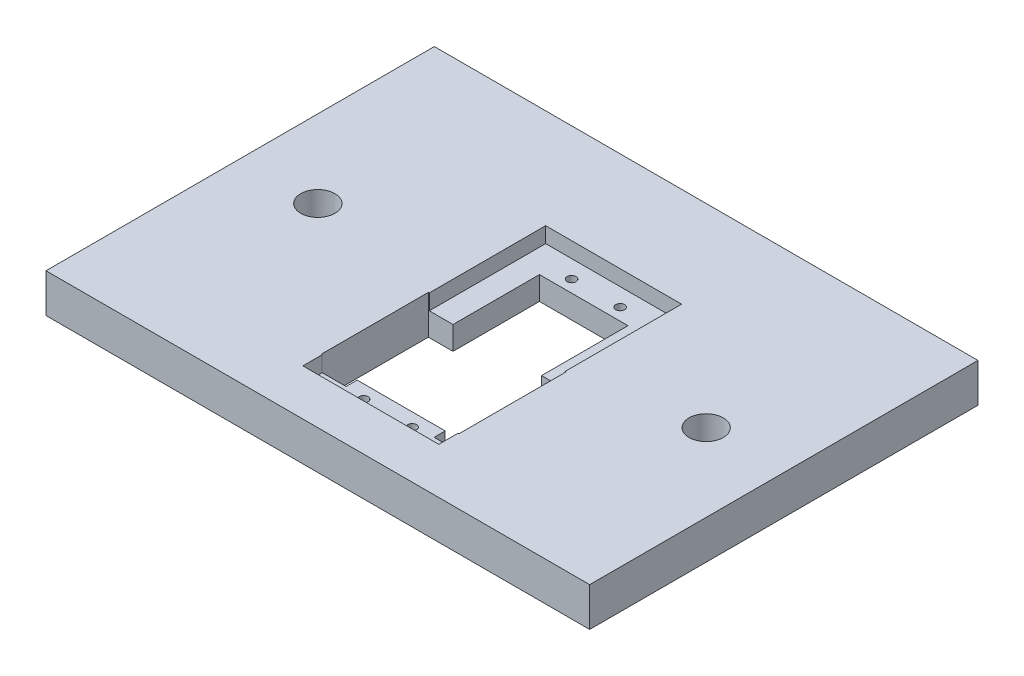
ISO-10303-21;
HEADER;
FILE_DESCRIPTION(('STEP AP214'),'2;1');
FILE_NAME('part.step','',(''),(''),'','','');
FILE_SCHEMA(('AUTOMOTIVE_DESIGN { 1 0 10303 214 1 1 1 1 }'));
ENDSEC;
DATA;
#1=APPLICATION_CONTEXT('core data for automotive mechanical design processes');
#2=APPLICATION_PROTOCOL_DEFINITION('international standard','automotive_design',2000,#1);
#3=PRODUCT_CONTEXT('',#1,'mechanical');
#4=PRODUCT('Part','Part','',(#3));
#5=PRODUCT_RELATED_PRODUCT_CATEGORY('part','',(#4));
#6=PRODUCT_DEFINITION_FORMATION('','',#4);
#7=PRODUCT_DEFINITION_CONTEXT('part definition',#1,'design');
#8=PRODUCT_DEFINITION('design','',#6,#7);
#9=PRODUCT_DEFINITION_SHAPE('','',#8);
#10=(LENGTH_UNIT() NAMED_UNIT(*) SI_UNIT(.MILLI.,.METRE.));
#11=(NAMED_UNIT(*) PLANE_ANGLE_UNIT() SI_UNIT($,.RADIAN.));
#12=(NAMED_UNIT(*) SI_UNIT($,.STERADIAN.) SOLID_ANGLE_UNIT());
#13=UNCERTAINTY_MEASURE_WITH_UNIT(LENGTH_MEASURE(1.E-05),#10,'distance_accuracy_value','');
#14=(GEOMETRIC_REPRESENTATION_CONTEXT(3) GLOBAL_UNCERTAINTY_ASSIGNED_CONTEXT((#13)) GLOBAL_UNIT_ASSIGNED_CONTEXT((#10,
#11,#12)) REPRESENTATION_CONTEXT('',''));
#15=CARTESIAN_POINT('',(0.,0.,0.));
#16=DIRECTION('',(0.,0.,1.));
#17=DIRECTION('',(1.,0.,0.));
#18=AXIS2_PLACEMENT_3D('',#15,#16,#17);
#19=CARTESIAN_POINT('',(-12.2080655373622,12.7,38.5061507826569));
#20=DIRECTION('',(0.,0.,-1.));
#21=DIRECTION('',(-1.,0.,0.));
#22=AXIS2_PLACEMENT_3D('',#19,#20,#21);
#23=PLANE('',#22);
#24=DIRECTION('',(0.,1.,0.));
#25=VECTOR('',#24,1.);
#26=CARTESIAN_POINT('',(-12.1271424501678,12.7,38.5061507826569));
#27=LINE('',#26,#25);
#28=CARTESIAN_POINT('',(-12.1271424501678,0.,38.5061507826569));
#29=VERTEX_POINT('',#28);
#30=CARTESIAN_POINT('',(-12.1271424501678,7.62,38.5061507826569));
#31=VERTEX_POINT('',#30);
#32=EDGE_CURVE('E406',#29,#31,#27,.T.);
#33=ORIENTED_EDGE('',*,*,#32,.T.);
#34=DIRECTION('',(1.,0.,0.));
#35=VECTOR('',#34,1.);
#36=CARTESIAN_POINT('',(-12.2080655373622,7.62,38.5061507826569));
#37=LINE('',#36,#35);
#38=CARTESIAN_POINT('',(16.6670113754435,7.62,38.5061507826569));
#39=VERTEX_POINT('',#38);
#40=EDGE_CURVE('E240',#31,#39,#37,.T.);
#41=ORIENTED_EDGE('',*,*,#40,.T.);
#42=DIRECTION('',(0.,-1.,0.));
#43=VECTOR('',#42,1.);
#44=CARTESIAN_POINT('',(16.6670113754435,12.7,38.5061507826569));
#45=LINE('',#44,#43);
#46=CARTESIAN_POINT('',(16.6670113754435,0.,38.5061507826569));
#47=VERTEX_POINT('',#46);
#48=EDGE_CURVE('E402',#39,#47,#45,.T.);
#49=ORIENTED_EDGE('',*,*,#48,.T.);
#50=DIRECTION('',(1.,0.,0.));
#51=VECTOR('',#50,1.);
#52=CARTESIAN_POINT('',(-12.2080655373622,0.,38.5061507826569));
#53=LINE('',#52,#51);
#54=EDGE_CURVE('E344',#29,#47,#53,.T.);
#55=ORIENTED_EDGE('',*,*,#54,.F.);
#56=EDGE_LOOP('',(#33,#41,#49,#55));
#57=FACE_BOUND('',#56,.T.);
#58=ADVANCED_FACE('F34',(#57),#23,.T.);
#59=CARTESIAN_POINT('',(-12.2080655373622,12.7,38.5061507826569));
#60=DIRECTION('',(1.,0.,0.));
#61=DIRECTION('',(0.,0.,-1.));
#62=AXIS2_PLACEMENT_3D('',#59,#60,#61);
#63=PLANE('',#62);
#64=DIRECTION('',(0.,-1.,0.));
#65=VECTOR('',#64,1.);
#66=CARTESIAN_POINT('',(-12.2080655373622,12.7,-21.1838492173431));
#67=LINE('',#66,#65);
#68=CARTESIAN_POINT('',(-12.2080655373622,7.62,-21.1838492173431));
#69=VERTEX_POINT('',#68);
#70=CARTESIAN_POINT('',(-12.2080655373622,0.,-21.1838492173431));
#71=VERTEX_POINT('',#70);
#72=EDGE_CURVE('E353',#69,#71,#67,.T.);
#73=ORIENTED_EDGE('',*,*,#72,.F.);
#74=DIRECTION('',(0.,0.,1.));
#75=VECTOR('',#74,1.);
#76=CARTESIAN_POINT('',(-12.2080655373622,7.62,38.5061507826569));
#77=LINE('',#76,#75);
#78=CARTESIAN_POINT('',(-12.2080655373622,7.62,7.08952578265694));
#79=VERTEX_POINT('',#78);
#80=EDGE_CURVE('E252',#69,#79,#77,.T.);
#81=ORIENTED_EDGE('',*,*,#80,.T.);
#82=DIRECTION('',(0.,-1.,0.));
#83=VECTOR('',#82,1.);
#84=CARTESIAN_POINT('',(-12.2080655373622,12.7,7.08952578265694));
#85=LINE('',#84,#83);
#86=CARTESIAN_POINT('',(-12.2080655373622,0.,7.08952578265694));
#87=VERTEX_POINT('',#86);
#88=EDGE_CURVE('E404',#79,#87,#85,.T.);
#89=ORIENTED_EDGE('',*,*,#88,.T.);
#90=DIRECTION('',(0.,0.,1.));
#91=VECTOR('',#90,1.);
#92=CARTESIAN_POINT('',(-12.2080655373622,0.,38.5061507826569));
#93=LINE('',#92,#91);
#94=EDGE_CURVE('E341',#71,#87,#93,.T.);
#95=ORIENTED_EDGE('',*,*,#94,.F.);
#96=EDGE_LOOP('',(#73,#81,#89,#95));
#97=FACE_BOUND('',#96,.T.);
#98=ADVANCED_FACE('F485',(#97),#63,.T.);
#99=CARTESIAN_POINT('',(16.7479344626378,12.7,38.5061507826569));
#100=DIRECTION('',(-1.,0.,0.));
#101=DIRECTION('',(0.,0.,1.));
#102=AXIS2_PLACEMENT_3D('',#99,#100,#101);
#103=PLANE('',#102);
#104=DIRECTION('',(0.,1.,0.));
#105=VECTOR('',#104,1.);
#106=CARTESIAN_POINT('',(16.7479344626378,12.7,7.08952578265694));
#107=LINE('',#106,#105);
#108=CARTESIAN_POINT('',(16.7479344626378,0.,7.08952578265694));
#109=VERTEX_POINT('',#108);
#110=CARTESIAN_POINT('',(16.7479344626378,7.62,7.08952578265694));
#111=VERTEX_POINT('',#110);
#112=EDGE_CURVE('E399',#109,#111,#107,.T.);
#113=ORIENTED_EDGE('',*,*,#112,.T.);
#114=DIRECTION('',(0.,0.,-1.));
#115=VECTOR('',#114,1.);
#116=CARTESIAN_POINT('',(16.7479344626378,7.62,38.5061507826569));
#117=LINE('',#116,#115);
#118=CARTESIAN_POINT('',(16.7479344626378,7.62,-21.1838492173431));
#119=VERTEX_POINT('',#118);
#120=EDGE_CURVE('E258',#111,#119,#117,.T.);
#121=ORIENTED_EDGE('',*,*,#120,.T.);
#122=DIRECTION('',(0.,-1.,0.));
#123=VECTOR('',#122,1.);
#124=CARTESIAN_POINT('',(16.7479344626378,12.7,-21.1838492173431));
#125=LINE('',#124,#123);
#126=CARTESIAN_POINT('',(16.7479344626378,0.,-21.1838492173431));
#127=VERTEX_POINT('',#126);
#128=EDGE_CURVE('E355',#119,#127,#125,.T.);
#129=ORIENTED_EDGE('',*,*,#128,.T.);
#130=DIRECTION('',(0.,0.,-1.));
#131=VECTOR('',#130,1.);
#132=CARTESIAN_POINT('',(16.7479344626378,0.,38.5061507826569));
#133=LINE('',#132,#131);
#134=EDGE_CURVE('E347',#109,#127,#133,.T.);
#135=ORIENTED_EDGE('',*,*,#134,.F.);
#136=EDGE_LOOP('',(#113,#121,#129,#135));
#137=FACE_BOUND('',#136,.T.);
#138=ADVANCED_FACE('F490',(#137),#103,.T.);
#139=CARTESIAN_POINT('',(-12.2080655373622,12.7,-21.1838492173431));
#140=DIRECTION('',(0.,0.,1.));
#141=DIRECTION('',(1.,0.,0.));
#142=AXIS2_PLACEMENT_3D('',#139,#140,#141);
#143=PLANE('',#142);
#144=ORIENTED_EDGE('',*,*,#128,.F.);
#145=DIRECTION('',(-1.,0.,0.));
#146=VECTOR('',#145,1.);
#147=CARTESIAN_POINT('',(-12.2080655373622,7.62,-21.1838492173431));
#148=LINE('',#147,#146);
#149=EDGE_CURVE('E255',#119,#69,#148,.T.);
#150=ORIENTED_EDGE('',*,*,#149,.T.);
#151=ORIENTED_EDGE('',*,*,#72,.T.);
#152=DIRECTION('',(-1.,0.,0.));
#153=VECTOR('',#152,1.);
#154=CARTESIAN_POINT('',(-12.2080655373622,0.,-21.1838492173431));
#155=LINE('',#154,#153);
#156=EDGE_CURVE('E350',#127,#71,#155,.T.);
#157=ORIENTED_EDGE('',*,*,#156,.F.);
#158=EDGE_LOOP('',(#144,#150,#151,#157));
#159=FACE_BOUND('',#158,.T.);
#160=ADVANCED_FACE('F588',(#159),#143,.T.);
#161=CARTESIAN_POINT('',(-5.66756553736215,12.7,42.8717757826569));
#162=DIRECTION('',(0.,-1.,0.));
#163=DIRECTION('',(0.,0.,-1.));
#164=AXIS2_PLACEMENT_3D('',#161,#162,#163);
#165=CYLINDRICAL_SURFACE('',#164,1.4605);
#166=CARTESIAN_POINT('',(-5.66756553736215,0.,42.8717757826569));
#167=DIRECTION('',(0.,1.,0.));
#168=DIRECTION('',(0.,0.,1.));
#169=AXIS2_PLACEMENT_3D('',#166,#167,#168);
#170=CIRCLE('',#169,1.4605);
#171=CARTESIAN_POINT('',(-5.66756553736215,0.,44.3322757826569));
#172=VERTEX_POINT('',#171);
#173=EDGE_CURVE('E338',#172,#172,#170,.T.);
#174=ORIENTED_EDGE('',*,*,#173,.F.);
#175=EDGE_LOOP('',(#174));
#176=FACE_BOUND('',#175,.T.);
#177=CARTESIAN_POINT('',(-5.66756553736215,7.62,42.8717757826569));
#178=DIRECTION('',(0.,1.,0.));
#179=DIRECTION('',(0.,0.,1.));
#180=AXIS2_PLACEMENT_3D('',#177,#178,#179);
#181=CIRCLE('',#180,1.4605);
#182=CARTESIAN_POINT('',(-5.66756553736215,7.62,44.3322757826569));
#183=VERTEX_POINT('',#182);
#184=EDGE_CURVE('E271',#183,#183,#181,.T.);
#185=ORIENTED_EDGE('',*,*,#184,.T.);
#186=EDGE_LOOP('',(#185));
#187=FACE_BOUND('',#186,.T.);
#188=ADVANCED_FACE('F579',(#176,#187),#165,.F.);
#189=CARTESIAN_POINT('',(10.2074344626382,12.7,42.8717757826569));
#190=DIRECTION('',(0.,-1.,0.));
#191=DIRECTION('',(0.,0.,-1.));
#192=AXIS2_PLACEMENT_3D('',#189,#190,#191);
#193=CYLINDRICAL_SURFACE('',#192,1.46049999999967);
#194=CARTESIAN_POINT('',(10.2074344626382,0.,42.8717757826569));
#195=DIRECTION('',(0.,1.,0.));
#196=DIRECTION('',(0.,0.,1.));
#197=AXIS2_PLACEMENT_3D('',#194,#195,#196);
#198=CIRCLE('',#197,1.46049999999967);
#199=CARTESIAN_POINT('',(10.2074344626382,0.,44.3322757826566));
#200=VERTEX_POINT('',#199);
#201=EDGE_CURVE('E335',#200,#200,#198,.T.);
#202=ORIENTED_EDGE('',*,*,#201,.F.);
#203=EDGE_LOOP('',(#202));
#204=FACE_BOUND('',#203,.T.);
#205=CARTESIAN_POINT('',(10.2074344626382,7.62,42.8717757826569));
#206=DIRECTION('',(0.,1.,0.));
#207=DIRECTION('',(0.,0.,1.));
#208=AXIS2_PLACEMENT_3D('',#205,#206,#207);
#209=CIRCLE('',#208,1.46049999999967);
#210=CARTESIAN_POINT('',(10.2074344626382,7.62,44.3322757826566));
#211=VERTEX_POINT('',#210);
#212=EDGE_CURVE('E268',#211,#211,#209,.T.);
#213=ORIENTED_EDGE('',*,*,#212,.T.);
#214=EDGE_LOOP('',(#213));
#215=FACE_BOUND('',#214,.T.);
#216=ADVANCED_FACE('F577',(#204,#215),#193,.F.);
#217=CARTESIAN_POINT('',(-5.66756553736239,12.7,-25.1494242173431));
#218=DIRECTION('',(0.,-1.,0.));
#219=DIRECTION('',(0.,0.,-1.));
#220=AXIS2_PLACEMENT_3D('',#217,#218,#219);
#221=CYLINDRICAL_SURFACE('',#220,1.4605);
#222=CARTESIAN_POINT('',(-5.66756553736239,0.,-25.1494242173431));
#223=DIRECTION('',(0.,1.,0.));
#224=DIRECTION('',(0.,0.,1.));
#225=AXIS2_PLACEMENT_3D('',#222,#223,#224);
#226=CIRCLE('',#225,1.4605);
#227=CARTESIAN_POINT('',(-5.66756553736239,0.,-23.6889242173431));
#228=VERTEX_POINT('',#227);
#229=EDGE_CURVE('E332',#228,#228,#226,.T.);
#230=ORIENTED_EDGE('',*,*,#229,.F.);
#231=EDGE_LOOP('',(#230));
#232=FACE_BOUND('',#231,.T.);
#233=CARTESIAN_POINT('',(-5.66756553736239,7.62,-25.1494242173431));
#234=DIRECTION('',(0.,1.,0.));
#235=DIRECTION('',(0.,0.,1.));
#236=AXIS2_PLACEMENT_3D('',#233,#234,#235);
#237=CIRCLE('',#236,1.4605);
#238=CARTESIAN_POINT('',(-5.66756553736239,7.62,-23.6889242173431));
#239=VERTEX_POINT('',#238);
#240=EDGE_CURVE('E265',#239,#239,#237,.T.);
#241=ORIENTED_EDGE('',*,*,#240,.T.);
#242=EDGE_LOOP('',(#241));
#243=FACE_BOUND('',#242,.T.);
#244=ADVANCED_FACE('F554',(#232,#243),#221,.F.);
#245=CARTESIAN_POINT('',(10.2074344626376,12.7,-25.1494242173431));
#246=DIRECTION('',(0.,-1.,0.));
#247=DIRECTION('',(0.,0.,-1.));
#248=AXIS2_PLACEMENT_3D('',#245,#246,#247);
#249=CYLINDRICAL_SURFACE('',#248,1.4605);
#250=CARTESIAN_POINT('',(10.2074344626376,0.,-25.1494242173431));
#251=DIRECTION('',(0.,1.,0.));
#252=DIRECTION('',(0.,0.,1.));
#253=AXIS2_PLACEMENT_3D('',#250,#251,#252);
#254=CIRCLE('',#253,1.4605);
#255=CARTESIAN_POINT('',(10.2074344626376,0.,-23.6889242173431));
#256=VERTEX_POINT('',#255);
#257=EDGE_CURVE('E329',#256,#256,#254,.T.);
#258=ORIENTED_EDGE('',*,*,#257,.F.);
#259=EDGE_LOOP('',(#258));
#260=FACE_BOUND('',#259,.T.);
#261=CARTESIAN_POINT('',(10.2074344626376,7.62,-25.1494242173431));
#262=DIRECTION('',(0.,1.,0.));
#263=DIRECTION('',(0.,0.,1.));
#264=AXIS2_PLACEMENT_3D('',#261,#262,#263);
#265=CIRCLE('',#264,1.4605);
#266=CARTESIAN_POINT('',(10.2074344626376,7.62,-23.6889242173431));
#267=VERTEX_POINT('',#266);
#268=EDGE_CURVE('E262',#267,#267,#265,.T.);
#269=ORIENTED_EDGE('',*,*,#268,.T.);
#270=EDGE_LOOP('',(#269));
#271=FACE_BOUND('',#270,.T.);
#272=ADVANCED_FACE('F551',(#260,#271),#249,.F.);
#273=CARTESIAN_POINT('',(16.6670113754435,12.7,7.08952578265694));
#274=DIRECTION('',(1.,0.,0.));
#275=DIRECTION('',(0.,0.,-1.));
#276=AXIS2_PLACEMENT_3D('',#273,#274,#275);
#277=PLANE('',#276);
#278=ORIENTED_EDGE('',*,*,#48,.F.);
#279=DIRECTION('',(0.,0.,1.));
#280=VECTOR('',#279,1.);
#281=CARTESIAN_POINT('',(16.6670113754435,7.62,7.08952578265694));
#282=LINE('',#281,#280);
#283=CARTESIAN_POINT('',(16.6670113754435,7.62,42.1415257826569));
#284=VERTEX_POINT('',#283);
#285=EDGE_CURVE('E243',#39,#284,#282,.T.);
#286=ORIENTED_EDGE('',*,*,#285,.T.);
#287=DIRECTION('',(0.,-1.,0.));
#288=VECTOR('',#287,1.);
#289=CARTESIAN_POINT('',(16.6670113754435,12.7,42.1415257826569));
#290=LINE('',#289,#288);
#291=CARTESIAN_POINT('',(16.6670113754435,0.,42.1415257826569));
#292=VERTEX_POINT('',#291);
#293=EDGE_CURVE('E324',#284,#292,#290,.T.);
#294=ORIENTED_EDGE('',*,*,#293,.T.);
#295=DIRECTION('',(0.,0.,1.));
#296=VECTOR('',#295,1.);
#297=CARTESIAN_POINT('',(16.6670113754435,0.,7.08952578265694));
#298=LINE('',#297,#296);
#299=EDGE_CURVE('E318',#47,#292,#298,.T.);
#300=ORIENTED_EDGE('',*,*,#299,.F.);
#301=EDGE_LOOP('',(#278,#286,#294,#300));
#302=FACE_BOUND('',#301,.T.);
#303=ADVANCED_FACE('F465',(#302),#277,.T.);
#304=CARTESIAN_POINT('',(-12.1271424501678,12.7,7.08952578265694));
#305=DIRECTION('',(-1.,0.,0.));
#306=DIRECTION('',(0.,0.,1.));
#307=AXIS2_PLACEMENT_3D('',#304,#305,#306);
#308=PLANE('',#307);
#309=DIRECTION('',(0.,-1.,0.));
#310=VECTOR('',#309,1.);
#311=CARTESIAN_POINT('',(-12.1271424501678,12.7,42.1415257826569));
#312=LINE('',#311,#310);
#313=CARTESIAN_POINT('',(-12.1271424501678,7.62,42.1415257826569));
#314=VERTEX_POINT('',#313);
#315=CARTESIAN_POINT('',(-12.1271424501678,0.,42.1415257826569));
#316=VERTEX_POINT('',#315);
#317=EDGE_CURVE('E287',#314,#316,#312,.T.);
#318=ORIENTED_EDGE('',*,*,#317,.F.);
#319=DIRECTION('',(0.,0.,-1.));
#320=VECTOR('',#319,1.);
#321=CARTESIAN_POINT('',(-12.1271424501678,7.62,7.08952578265694));
#322=LINE('',#321,#320);
#323=EDGE_CURVE('E57',#314,#31,#322,.T.);
#324=ORIENTED_EDGE('',*,*,#323,.T.);
#325=ORIENTED_EDGE('',*,*,#32,.F.);
#326=DIRECTION('',(0.,0.,-1.));
#327=VECTOR('',#326,1.);
#328=CARTESIAN_POINT('',(-12.1271424501678,0.,7.08952578265694));
#329=LINE('',#328,#327);
#330=EDGE_CURVE('E278',#316,#29,#329,.T.);
#331=ORIENTED_EDGE('',*,*,#330,.F.);
#332=EDGE_LOOP('',(#318,#324,#325,#331));
#333=FACE_BOUND('',#332,.T.);
#334=ADVANCED_FACE('F471',(#333),#308,.T.);
#335=CARTESIAN_POINT('',(0.,12.7,0.));
#336=DIRECTION('',(0.,1.,0.));
#337=DIRECTION('',(0.,0.,1.));
#338=AXIS2_PLACEMENT_3D('',#335,#336,#337);
#339=PLANE('',#338);
#340=DIRECTION('',(0.,0.,-1.));
#341=VECTOR('',#340,1.);
#342=CARTESIAN_POINT('',(24.4949344626378,12.7,-30.9628492173431));
#343=LINE('',#342,#341);
#344=CARTESIAN_POINT('',(24.4949344626378,12.7,48.4375507826569));
#345=VERTEX_POINT('',#344);
#346=CARTESIAN_POINT('',(24.4949344626378,12.7,42.1415257826569));
#347=VERTEX_POINT('',#346);
#348=EDGE_CURVE('E224',#345,#347,#343,.T.);
#349=ORIENTED_EDGE('',*,*,#348,.F.);
#350=DIRECTION('',(1.,0.,0.));
#351=VECTOR('',#350,1.);
#352=CARTESIAN_POINT('',(-19.9550655373622,12.7,48.4375507826569));
#353=LINE('',#352,#351);
#354=CARTESIAN_POINT('',(-19.9550655373622,12.7,48.4375507826569));
#355=VERTEX_POINT('',#354);
#356=EDGE_CURVE('E203',#355,#345,#353,.T.);
#357=ORIENTED_EDGE('',*,*,#356,.F.);
#358=DIRECTION('',(0.,0.,1.));
#359=VECTOR('',#358,1.);
#360=CARTESIAN_POINT('',(-19.9550655373621,12.7,-30.9628492173431));
#361=LINE('',#360,#359);
#362=CARTESIAN_POINT('',(-19.9550655373622,12.7,42.1415257826569));
#363=VERTEX_POINT('',#362);
#364=EDGE_CURVE('E228',#363,#355,#361,.T.);
#365=ORIENTED_EDGE('',*,*,#364,.F.);
#366=DIRECTION('',(1.,0.,0.));
#367=VECTOR('',#366,1.);
#368=CARTESIAN_POINT('',(-20.2551424501678,12.7,42.1415257826569));
#369=LINE('',#368,#367);
#370=CARTESIAN_POINT('',(-20.2551424501678,12.7,42.1415257826569));
#371=VERTEX_POINT('',#370);
#372=EDGE_CURVE('E284',#371,#363,#369,.T.);
#373=ORIENTED_EDGE('',*,*,#372,.F.);
#374=DIRECTION('',(0.,0.,1.));
#375=VECTOR('',#374,1.);
#376=CARTESIAN_POINT('',(-20.2551424501678,12.7,7.08952578265694));
#377=LINE('',#376,#375);
#378=CARTESIAN_POINT('',(-20.2551424501678,12.7,7.08952578265694));
#379=VERTEX_POINT('',#378);
#380=EDGE_CURVE('E281',#379,#371,#377,.T.);
#381=ORIENTED_EDGE('',*,*,#380,.F.);
#382=DIRECTION('',(-1.,0.,0.));
#383=VECTOR('',#382,1.);
#384=CARTESIAN_POINT('',(-20.2551424501678,12.7,7.08952578265694));
#385=LINE('',#384,#383);
#386=CARTESIAN_POINT('',(-19.9550655373621,12.7,7.08952578265692));
#387=VERTEX_POINT('',#386);
#388=EDGE_CURVE('E279',#387,#379,#385,.T.);
#389=ORIENTED_EDGE('',*,*,#388,.F.);
#390=CARTESIAN_POINT('',(-19.9550655373621,12.7,-30.9628492173431));
#391=VERTEX_POINT('',#390);
#392=EDGE_CURVE('E229',#391,#387,#361,.T.);
#393=ORIENTED_EDGE('',*,*,#392,.F.);
#394=DIRECTION('',(-1.,0.,0.));
#395=VECTOR('',#394,1.);
#396=CARTESIAN_POINT('',(-19.9550655373621,12.7,-30.9628492173431));
#397=LINE('',#396,#395);
#398=CARTESIAN_POINT('',(24.4949344626378,12.7,-30.9628492173431));
#399=VERTEX_POINT('',#398);
#400=EDGE_CURVE('E226',#399,#391,#397,.T.);
#401=ORIENTED_EDGE('',*,*,#400,.F.);
#402=CARTESIAN_POINT('',(24.4949344626378,12.7,7.08952578265692));
#403=VERTEX_POINT('',#402);
#404=EDGE_CURVE('E209',#403,#399,#343,.T.);
#405=ORIENTED_EDGE('',*,*,#404,.F.);
#406=DIRECTION('',(-1.,0.,0.));
#407=VECTOR('',#406,1.);
#408=CARTESIAN_POINT('',(16.6670113754435,12.7,7.08952578265694));
#409=LINE('',#408,#407);
#410=CARTESIAN_POINT('',(24.7950113754435,12.7,7.08952578265694));
#411=VERTEX_POINT('',#410);
#412=EDGE_CURVE('E306',#411,#403,#409,.T.);
#413=ORIENTED_EDGE('',*,*,#412,.F.);
#414=DIRECTION('',(0.,0.,-1.));
#415=VECTOR('',#414,1.);
#416=CARTESIAN_POINT('',(24.7950113754435,12.7,7.08952578265694));
#417=LINE('',#416,#415);
#418=CARTESIAN_POINT('',(24.7950113754435,12.7,42.1415257826569));
#419=VERTEX_POINT('',#418);
#420=EDGE_CURVE('E304',#419,#411,#417,.T.);
#421=ORIENTED_EDGE('',*,*,#420,.F.);
#422=DIRECTION('',(1.,0.,0.));
#423=VECTOR('',#422,1.);
#424=CARTESIAN_POINT('',(16.6670113754435,12.7,42.1415257826569));
#425=LINE('',#424,#423);
#426=EDGE_CURVE('E310',#347,#419,#425,.T.);
#427=ORIENTED_EDGE('',*,*,#426,.F.);
#428=EDGE_LOOP('',(#349,#357,#365,#373,#381,#389,#393,#401,#405,#413,#421,#427));
#429=FACE_BOUND('',#428,.T.);
#430=CARTESIAN_POINT('',(-63.5,12.7,0.));
#431=DIRECTION('',(0.,1.,0.));
#432=DIRECTION('',(0.,0.,1.));
#433=AXIS2_PLACEMENT_3D('',#430,#431,#432);
#434=CIRCLE('',#433,5.58799999999999);
#435=CARTESIAN_POINT('',(-63.5,12.7,5.58799999999999));
#436=VERTEX_POINT('',#435);
#437=EDGE_CURVE('E364',#436,#436,#434,.T.);
#438=ORIENTED_EDGE('',*,*,#437,.F.);
#439=EDGE_LOOP('',(#438));
#440=FACE_BOUND('',#439,.T.);
#441=DIRECTION('',(0.,0.,-1.));
#442=VECTOR('',#441,1.);
#443=CARTESIAN_POINT('',(88.9,12.7,-63.5));
#444=LINE('',#443,#442);
#445=CARTESIAN_POINT('',(88.9,12.7,63.5));
#446=VERTEX_POINT('',#445);
#447=CARTESIAN_POINT('',(88.9,12.7,-63.5));
#448=VERTEX_POINT('',#447);
#449=EDGE_CURVE('E370',#446,#448,#444,.T.);
#450=ORIENTED_EDGE('',*,*,#449,.T.);
#451=DIRECTION('',(-1.,0.,0.));
#452=VECTOR('',#451,1.);
#453=CARTESIAN_POINT('',(-88.9,12.7,-63.5));
#454=LINE('',#453,#452);
#455=CARTESIAN_POINT('',(-88.9,12.7,-63.5));
#456=VERTEX_POINT('',#455);
#457=EDGE_CURVE('E373',#448,#456,#454,.T.);
#458=ORIENTED_EDGE('',*,*,#457,.T.);
#459=DIRECTION('',(0.,0.,1.));
#460=VECTOR('',#459,1.);
#461=CARTESIAN_POINT('',(-88.9,12.7,-63.5));
#462=LINE('',#461,#460);
#463=CARTESIAN_POINT('',(-88.9,12.7,63.5));
#464=VERTEX_POINT('',#463);
#465=EDGE_CURVE('E376',#456,#464,#462,.T.);
#466=ORIENTED_EDGE('',*,*,#465,.T.);
#467=DIRECTION('',(1.,0.,0.));
#468=VECTOR('',#467,1.);
#469=CARTESIAN_POINT('',(-88.9,12.7,63.5));
#470=LINE('',#469,#468);
#471=EDGE_CURVE('E378',#464,#446,#470,.T.);
#472=ORIENTED_EDGE('',*,*,#471,.T.);
#473=EDGE_LOOP('',(#450,#458,#466,#472));
#474=FACE_BOUND('',#473,.T.);
#475=CARTESIAN_POINT('',(63.5,12.7,0.));
#476=DIRECTION('',(0.,1.,0.));
#477=DIRECTION('',(0.,0.,1.));
#478=AXIS2_PLACEMENT_3D('',#475,#476,#477);
#479=CIRCLE('',#478,5.58799999999999);
#480=CARTESIAN_POINT('',(63.5,12.7,5.58799999999999));
#481=VERTEX_POINT('',#480);
#482=EDGE_CURVE('E358',#481,#481,#479,.T.);
#483=ORIENTED_EDGE('',*,*,#482,.F.);
#484=EDGE_LOOP('',(#483));
#485=FACE_BOUND('',#484,.T.);
#486=ADVANCED_FACE('F421',(#429,#440,#474,#485),#339,.T.);
#487=CARTESIAN_POINT('',(0.,0.,0.));
#488=DIRECTION('',(0.,1.,0.));
#489=DIRECTION('',(0.,0.,1.));
#490=AXIS2_PLACEMENT_3D('',#487,#488,#489);
#491=PLANE('',#490);
#492=CARTESIAN_POINT('',(63.5,0.,0.));
#493=DIRECTION('',(0.,1.,0.));
#494=DIRECTION('',(0.,0.,1.));
#495=AXIS2_PLACEMENT_3D('',#492,#493,#494);
#496=CIRCLE('',#495,5.58799999999999);
#497=CARTESIAN_POINT('',(63.5,0.,5.58799999999999));
#498=VERTEX_POINT('',#497);
#499=EDGE_CURVE('E357',#498,#498,#496,.T.);
#500=ORIENTED_EDGE('',*,*,#499,.T.);
#501=EDGE_LOOP('',(#500));
#502=FACE_BOUND('',#501,.T.);
#503=CARTESIAN_POINT('',(-63.5,0.,0.));
#504=DIRECTION('',(0.,1.,0.));
#505=DIRECTION('',(0.,0.,1.));
#506=AXIS2_PLACEMENT_3D('',#503,#504,#505);
#507=CIRCLE('',#506,5.58799999999999);
#508=CARTESIAN_POINT('',(-63.5,0.,5.58799999999999));
#509=VERTEX_POINT('',#508);
#510=EDGE_CURVE('E361',#509,#509,#507,.T.);
#511=ORIENTED_EDGE('',*,*,#510,.T.);
#512=EDGE_LOOP('',(#511));
#513=FACE_BOUND('',#512,.T.);
#514=DIRECTION('',(0.,0.,-1.));
#515=VECTOR('',#514,1.);
#516=CARTESIAN_POINT('',(88.9,0.,-63.5));
#517=LINE('',#516,#515);
#518=CARTESIAN_POINT('',(88.9,0.,63.5));
#519=VERTEX_POINT('',#518);
#520=CARTESIAN_POINT('',(88.9,0.,-63.5));
#521=VERTEX_POINT('',#520);
#522=EDGE_CURVE('E367',#519,#521,#517,.T.);
#523=ORIENTED_EDGE('',*,*,#522,.F.);
#524=DIRECTION('',(1.,0.,0.));
#525=VECTOR('',#524,1.);
#526=CARTESIAN_POINT('',(-88.9,0.,63.5));
#527=LINE('',#526,#525);
#528=CARTESIAN_POINT('',(-88.9,0.,63.5));
#529=VERTEX_POINT('',#528);
#530=EDGE_CURVE('E374',#529,#519,#527,.T.);
#531=ORIENTED_EDGE('',*,*,#530,.F.);
#532=DIRECTION('',(0.,0.,1.));
#533=VECTOR('',#532,1.);
#534=CARTESIAN_POINT('',(-88.9,0.,-63.5));
#535=LINE('',#534,#533);
#536=CARTESIAN_POINT('',(-88.9,0.,-63.5));
#537=VERTEX_POINT('',#536);
#538=EDGE_CURVE('E385',#537,#529,#535,.T.);
#539=ORIENTED_EDGE('',*,*,#538,.F.);
#540=DIRECTION('',(-1.,0.,0.));
#541=VECTOR('',#540,1.);
#542=CARTESIAN_POINT('',(-88.9,0.,-63.5));
#543=LINE('',#542,#541);
#544=EDGE_CURVE('E383',#521,#537,#543,.T.);
#545=ORIENTED_EDGE('',*,*,#544,.F.);
#546=EDGE_LOOP('',(#523,#531,#539,#545));
#547=FACE_BOUND('',#546,.T.);
#548=ORIENTED_EDGE('',*,*,#173,.T.);
#549=EDGE_LOOP('',(#548));
#550=FACE_BOUND('',#549,.T.);
#551=ORIENTED_EDGE('',*,*,#201,.T.);
#552=EDGE_LOOP('',(#551));
#553=FACE_BOUND('',#552,.T.);
#554=ORIENTED_EDGE('',*,*,#229,.T.);
#555=EDGE_LOOP('',(#554));
#556=FACE_BOUND('',#555,.T.);
#557=ORIENTED_EDGE('',*,*,#257,.T.);
#558=EDGE_LOOP('',(#557));
#559=FACE_BOUND('',#558,.T.);
#560=ORIENTED_EDGE('',*,*,#330,.T.);
#561=ORIENTED_EDGE('',*,*,#54,.T.);
#562=ORIENTED_EDGE('',*,*,#299,.T.);
#563=DIRECTION('',(1.,0.,0.));
#564=VECTOR('',#563,1.);
#565=CARTESIAN_POINT('',(16.6670113754435,0.,42.1415257826569));
#566=LINE('',#565,#564);
#567=CARTESIAN_POINT('',(24.7950113754435,0.,42.1415257826569));
#568=VERTEX_POINT('',#567);
#569=EDGE_CURVE('E307',#292,#568,#566,.T.);
#570=ORIENTED_EDGE('',*,*,#569,.T.);
#571=DIRECTION('',(0.,0.,-1.));
#572=VECTOR('',#571,1.);
#573=CARTESIAN_POINT('',(24.7950113754435,0.,7.08952578265694));
#574=LINE('',#573,#572);
#575=CARTESIAN_POINT('',(24.7950113754435,0.,7.08952578265694));
#576=VERTEX_POINT('',#575);
#577=EDGE_CURVE('E303',#568,#576,#574,.T.);
#578=ORIENTED_EDGE('',*,*,#577,.T.);
#579=DIRECTION('',(-1.,0.,0.));
#580=VECTOR('',#579,1.);
#581=CARTESIAN_POINT('',(16.6670113754435,0.,7.08952578265694));
#582=LINE('',#581,#580);
#583=EDGE_CURVE('E315',#576,#109,#582,.T.);
#584=ORIENTED_EDGE('',*,*,#583,.T.);
#585=ORIENTED_EDGE('',*,*,#134,.T.);
#586=ORIENTED_EDGE('',*,*,#156,.T.);
#587=ORIENTED_EDGE('',*,*,#94,.T.);
#588=DIRECTION('',(-1.,0.,0.));
#589=VECTOR('',#588,1.);
#590=CARTESIAN_POINT('',(-20.2551424501678,0.,7.08952578265694));
#591=LINE('',#590,#589);
#592=CARTESIAN_POINT('',(-20.2551424501678,0.,7.08952578265694));
#593=VERTEX_POINT('',#592);
#594=EDGE_CURVE('E290',#87,#593,#591,.T.);
#595=ORIENTED_EDGE('',*,*,#594,.T.);
#596=DIRECTION('',(0.,0.,1.));
#597=VECTOR('',#596,1.);
#598=CARTESIAN_POINT('',(-20.2551424501678,0.,7.08952578265694));
#599=LINE('',#598,#597);
#600=CARTESIAN_POINT('',(-20.2551424501678,0.,42.1415257826569));
#601=VERTEX_POINT('',#600);
#602=EDGE_CURVE('E293',#593,#601,#599,.T.);
#603=ORIENTED_EDGE('',*,*,#602,.T.);
#604=DIRECTION('',(1.,0.,0.));
#605=VECTOR('',#604,1.);
#606=CARTESIAN_POINT('',(-20.2551424501678,0.,42.1415257826569));
#607=LINE('',#606,#605);
#608=EDGE_CURVE('E282',#601,#316,#607,.T.);
#609=ORIENTED_EDGE('',*,*,#608,.T.);
#610=EDGE_LOOP('',(#560,#561,#562,#570,#578,#584,#585,#586,#587,#595,#603,#609));
#611=FACE_BOUND('',#610,.T.);
#612=ADVANCED_FACE('F450',(#502,#513,#547,#550,#553,#556,#559,#611),#491,.F.);
#613=CARTESIAN_POINT('',(88.9,12.7,-63.5));
#614=DIRECTION('',(-1.,0.,0.));
#615=DIRECTION('',(0.,0.,1.));
#616=AXIS2_PLACEMENT_3D('',#613,#614,#615);
#617=PLANE('',#616);
#618=ORIENTED_EDGE('',*,*,#522,.T.);
#619=DIRECTION('',(0.,-1.,0.));
#620=VECTOR('',#619,1.);
#621=CARTESIAN_POINT('',(88.9,12.7,-63.5));
#622=LINE('',#621,#620);
#623=EDGE_CURVE('E396',#448,#521,#622,.T.);
#624=ORIENTED_EDGE('',*,*,#623,.F.);
#625=ORIENTED_EDGE('',*,*,#449,.F.);
#626=DIRECTION('',(0.,-1.,0.));
#627=VECTOR('',#626,1.);
#628=CARTESIAN_POINT('',(88.9,12.7,63.5));
#629=LINE('',#628,#627);
#630=EDGE_CURVE('E380',#446,#519,#629,.T.);
#631=ORIENTED_EDGE('',*,*,#630,.T.);
#632=EDGE_LOOP('',(#618,#624,#625,#631));
#633=FACE_BOUND('',#632,.T.);
#634=ADVANCED_FACE('F36',(#633),#617,.F.);
#635=CARTESIAN_POINT('',(-88.9,12.7,-63.5));
#636=DIRECTION('',(0.,0.,1.));
#637=DIRECTION('',(1.,0.,0.));
#638=AXIS2_PLACEMENT_3D('',#635,#636,#637);
#639=PLANE('',#638);
#640=ORIENTED_EDGE('',*,*,#544,.T.);
#641=DIRECTION('',(0.,-1.,0.));
#642=VECTOR('',#641,1.);
#643=CARTESIAN_POINT('',(-88.9,12.7,-63.5));
#644=LINE('',#643,#642);
#645=EDGE_CURVE('E393',#456,#537,#644,.T.);
#646=ORIENTED_EDGE('',*,*,#645,.F.);
#647=ORIENTED_EDGE('',*,*,#457,.F.);
#648=ORIENTED_EDGE('',*,*,#623,.T.);
#649=EDGE_LOOP('',(#640,#646,#647,#648));
#650=FACE_BOUND('',#649,.T.);
#651=ADVANCED_FACE('F515',(#650),#639,.F.);
#652=CARTESIAN_POINT('',(-88.9,12.7,-63.5));
#653=DIRECTION('',(1.,0.,0.));
#654=DIRECTION('',(0.,0.,-1.));
#655=AXIS2_PLACEMENT_3D('',#652,#653,#654);
#656=PLANE('',#655);
#657=ORIENTED_EDGE('',*,*,#538,.T.);
#658=DIRECTION('',(0.,-1.,0.));
#659=VECTOR('',#658,1.);
#660=CARTESIAN_POINT('',(-88.9,12.7,63.5));
#661=LINE('',#660,#659);
#662=EDGE_CURVE('E390',#464,#529,#661,.T.);
#663=ORIENTED_EDGE('',*,*,#662,.F.);
#664=ORIENTED_EDGE('',*,*,#465,.F.);
#665=ORIENTED_EDGE('',*,*,#645,.T.);
#666=EDGE_LOOP('',(#657,#663,#664,#665));
#667=FACE_BOUND('',#666,.T.);
#668=ADVANCED_FACE('F512',(#667),#656,.F.);
#669=CARTESIAN_POINT('',(-88.9,12.7,63.5));
#670=DIRECTION('',(0.,0.,-1.));
#671=DIRECTION('',(-1.,0.,0.));
#672=AXIS2_PLACEMENT_3D('',#669,#670,#671);
#673=PLANE('',#672);
#674=ORIENTED_EDGE('',*,*,#530,.T.);
#675=ORIENTED_EDGE('',*,*,#630,.F.);
#676=ORIENTED_EDGE('',*,*,#471,.F.);
#677=ORIENTED_EDGE('',*,*,#662,.T.);
#678=EDGE_LOOP('',(#674,#675,#676,#677));
#679=FACE_BOUND('',#678,.T.);
#680=ADVANCED_FACE('F503',(#679),#673,.F.);
#681=CARTESIAN_POINT('',(-63.5,12.7,0.));
#682=DIRECTION('',(0.,-1.,0.));
#683=DIRECTION('',(0.,0.,-1.));
#684=AXIS2_PLACEMENT_3D('',#681,#682,#683);
#685=CYLINDRICAL_SURFACE('',#684,5.58799999999999);
#686=ORIENTED_EDGE('',*,*,#437,.T.);
#687=EDGE_LOOP('',(#686));
#688=FACE_BOUND('',#687,.T.);
#689=ORIENTED_EDGE('',*,*,#510,.F.);
#690=EDGE_LOOP('',(#689));
#691=FACE_BOUND('',#690,.T.);
#692=ADVANCED_FACE('F499',(#688,#691),#685,.F.);
#693=CARTESIAN_POINT('',(63.5,12.7,0.));
#694=DIRECTION('',(0.,-1.,0.));
#695=DIRECTION('',(0.,0.,-1.));
#696=AXIS2_PLACEMENT_3D('',#693,#694,#695);
#697=CYLINDRICAL_SURFACE('',#696,5.58799999999999);
#698=ORIENTED_EDGE('',*,*,#482,.T.);
#699=EDGE_LOOP('',(#698));
#700=FACE_BOUND('',#699,.T.);
#701=ORIENTED_EDGE('',*,*,#499,.F.);
#702=EDGE_LOOP('',(#701));
#703=FACE_BOUND('',#702,.T.);
#704=ADVANCED_FACE('F496',(#700,#703),#697,.F.);
#705=CARTESIAN_POINT('',(24.7950113754435,12.7,7.08952578265694));
#706=DIRECTION('',(-1.,0.,0.));
#707=DIRECTION('',(0.,0.,1.));
#708=AXIS2_PLACEMENT_3D('',#705,#706,#707);
#709=PLANE('',#708);
#710=ORIENTED_EDGE('',*,*,#577,.F.);
#711=DIRECTION('',(0.,-1.,0.));
#712=VECTOR('',#711,1.);
#713=CARTESIAN_POINT('',(24.7950113754435,12.7,42.1415257826569));
#714=LINE('',#713,#712);
#715=EDGE_CURVE('E312',#419,#568,#714,.T.);
#716=ORIENTED_EDGE('',*,*,#715,.F.);
#717=ORIENTED_EDGE('',*,*,#420,.T.);
#718=DIRECTION('',(0.,-1.,0.));
#719=VECTOR('',#718,1.);
#720=CARTESIAN_POINT('',(24.7950113754435,12.7,7.08952578265694));
#721=LINE('',#720,#719);
#722=EDGE_CURVE('E326',#411,#576,#721,.T.);
#723=ORIENTED_EDGE('',*,*,#722,.T.);
#724=EDGE_LOOP('',(#710,#716,#717,#723));
#725=FACE_BOUND('',#724,.T.);
#726=ADVANCED_FACE('F447',(#725),#709,.T.);
#727=CARTESIAN_POINT('',(16.6670113754435,12.7,7.08952578265694));
#728=DIRECTION('',(0.,0.,1.));
#729=DIRECTION('',(1.,0.,0.));
#730=AXIS2_PLACEMENT_3D('',#727,#728,#729);
#731=PLANE('',#730);
#732=DIRECTION('',(0.,1.,0.));
#733=VECTOR('',#732,1.);
#734=CARTESIAN_POINT('',(24.4949344626378,12.7,7.08952578265694));
#735=LINE('',#734,#733);
#736=CARTESIAN_POINT('',(24.4949344626378,7.62,7.08952578265692));
#737=VERTEX_POINT('',#736);
#738=EDGE_CURVE('E276',#737,#403,#735,.T.);
#739=ORIENTED_EDGE('',*,*,#738,.F.);
#740=DIRECTION('',(-1.,0.,0.));
#741=VECTOR('',#740,1.);
#742=CARTESIAN_POINT('',(16.6670113754435,7.62,7.08952578265694));
#743=LINE('',#742,#741);
#744=EDGE_CURVE('E199',#737,#111,#743,.T.);
#745=ORIENTED_EDGE('',*,*,#744,.T.);
#746=ORIENTED_EDGE('',*,*,#112,.F.);
#747=ORIENTED_EDGE('',*,*,#583,.F.);
#748=ORIENTED_EDGE('',*,*,#722,.F.);
#749=ORIENTED_EDGE('',*,*,#412,.T.);
#750=EDGE_LOOP('',(#739,#745,#746,#747,#748,#749));
#751=FACE_BOUND('',#750,.T.);
#752=ADVANCED_FACE('F444',(#751),#731,.T.);
#753=CARTESIAN_POINT('',(16.6670113754435,12.7,42.1415257826569));
#754=DIRECTION('',(0.,0.,-1.));
#755=DIRECTION('',(-1.,0.,0.));
#756=AXIS2_PLACEMENT_3D('',#753,#754,#755);
#757=PLANE('',#756);
#758=DIRECTION('',(0.,-1.,0.));
#759=VECTOR('',#758,1.);
#760=CARTESIAN_POINT('',(24.4949344626378,12.7,42.1415257826569));
#761=LINE('',#760,#759);
#762=CARTESIAN_POINT('',(24.4949344626378,7.62,42.1415257826569));
#763=VERTEX_POINT('',#762);
#764=EDGE_CURVE('E11',#347,#763,#761,.T.);
#765=ORIENTED_EDGE('',*,*,#764,.F.);
#766=ORIENTED_EDGE('',*,*,#426,.T.);
#767=ORIENTED_EDGE('',*,*,#715,.T.);
#768=ORIENTED_EDGE('',*,*,#569,.F.);
#769=ORIENTED_EDGE('',*,*,#293,.F.);
#770=DIRECTION('',(1.,0.,0.));
#771=VECTOR('',#770,1.);
#772=CARTESIAN_POINT('',(16.6670113754435,7.62,42.1415257826569));
#773=LINE('',#772,#771);
#774=EDGE_CURVE('E246',#284,#763,#773,.T.);
#775=ORIENTED_EDGE('',*,*,#774,.T.);
#776=EDGE_LOOP('',(#765,#766,#767,#768,#769,#775));
#777=FACE_BOUND('',#776,.T.);
#778=ADVANCED_FACE('F457',(#777),#757,.T.);
#779=CARTESIAN_POINT('',(-20.2551424501678,12.7,7.08952578265694));
#780=DIRECTION('',(0.,0.,1.));
#781=DIRECTION('',(1.,0.,0.));
#782=AXIS2_PLACEMENT_3D('',#779,#780,#781);
#783=PLANE('',#782);
#784=DIRECTION('',(0.,-1.,0.));
#785=VECTOR('',#784,1.);
#786=CARTESIAN_POINT('',(-19.9550655373621,12.7,7.08952578265694));
#787=LINE('',#786,#785);
#788=CARTESIAN_POINT('',(-19.9550655373622,7.62,7.08952578265694));
#789=VERTEX_POINT('',#788);
#790=EDGE_CURVE('E274',#387,#789,#787,.T.);
#791=ORIENTED_EDGE('',*,*,#790,.F.);
#792=ORIENTED_EDGE('',*,*,#388,.T.);
#793=DIRECTION('',(0.,-1.,0.));
#794=VECTOR('',#793,1.);
#795=CARTESIAN_POINT('',(-20.2551424501678,12.7,7.08952578265694));
#796=LINE('',#795,#794);
#797=EDGE_CURVE('E301',#379,#593,#796,.T.);
#798=ORIENTED_EDGE('',*,*,#797,.T.);
#799=ORIENTED_EDGE('',*,*,#594,.F.);
#800=ORIENTED_EDGE('',*,*,#88,.F.);
#801=DIRECTION('',(-1.,0.,0.));
#802=VECTOR('',#801,1.);
#803=CARTESIAN_POINT('',(-20.2551424501678,7.62,7.08952578265694));
#804=LINE('',#803,#802);
#805=EDGE_CURVE('E249',#79,#789,#804,.T.);
#806=ORIENTED_EDGE('',*,*,#805,.T.);
#807=EDGE_LOOP('',(#791,#792,#798,#799,#800,#806));
#808=FACE_BOUND('',#807,.T.);
#809=ADVANCED_FACE('F435',(#808),#783,.T.);
#810=CARTESIAN_POINT('',(-20.2551424501678,12.7,7.08952578265694));
#811=DIRECTION('',(1.,0.,0.));
#812=DIRECTION('',(0.,0.,-1.));
#813=AXIS2_PLACEMENT_3D('',#810,#811,#812);
#814=PLANE('',#813);
#815=ORIENTED_EDGE('',*,*,#602,.F.);
#816=ORIENTED_EDGE('',*,*,#797,.F.);
#817=ORIENTED_EDGE('',*,*,#380,.T.);
#818=DIRECTION('',(0.,-1.,0.));
#819=VECTOR('',#818,1.);
#820=CARTESIAN_POINT('',(-20.2551424501678,12.7,42.1415257826569));
#821=LINE('',#820,#819);
#822=EDGE_CURVE('E299',#371,#601,#821,.T.);
#823=ORIENTED_EDGE('',*,*,#822,.T.);
#824=EDGE_LOOP('',(#815,#816,#817,#823));
#825=FACE_BOUND('',#824,.T.);
#826=ADVANCED_FACE('F429',(#825),#814,.T.);
#827=CARTESIAN_POINT('',(-20.2551424501678,12.7,42.1415257826569));
#828=DIRECTION('',(0.,0.,-1.));
#829=DIRECTION('',(-1.,0.,0.));
#830=AXIS2_PLACEMENT_3D('',#827,#828,#829);
#831=PLANE('',#830);
#832=DIRECTION('',(0.,1.,0.));
#833=VECTOR('',#832,1.);
#834=CARTESIAN_POINT('',(-19.9550655373622,12.7,42.1415257826569));
#835=LINE('',#834,#833);
#836=CARTESIAN_POINT('',(-19.9550655373622,7.62,42.1415257826569));
#837=VERTEX_POINT('',#836);
#838=EDGE_CURVE('E42',#837,#363,#835,.T.);
#839=ORIENTED_EDGE('',*,*,#838,.F.);
#840=DIRECTION('',(1.,0.,0.));
#841=VECTOR('',#840,1.);
#842=CARTESIAN_POINT('',(-20.2551424501678,7.62,42.1415257826569));
#843=LINE('',#842,#841);
#844=EDGE_CURVE('E409',#837,#314,#843,.T.);
#845=ORIENTED_EDGE('',*,*,#844,.T.);
#846=ORIENTED_EDGE('',*,*,#317,.T.);
#847=ORIENTED_EDGE('',*,*,#608,.F.);
#848=ORIENTED_EDGE('',*,*,#822,.F.);
#849=ORIENTED_EDGE('',*,*,#372,.T.);
#850=EDGE_LOOP('',(#839,#845,#846,#847,#848,#849));
#851=FACE_BOUND('',#850,.T.);
#852=ADVANCED_FACE('F425',(#851),#831,.T.);
#853=CARTESIAN_POINT('',(0.,7.62,0.));
#854=DIRECTION('',(0.,1.,0.));
#855=DIRECTION('',(0.,0.,1.));
#856=AXIS2_PLACEMENT_3D('',#853,#854,#855);
#857=PLANE('',#856);
#858=ORIENTED_EDGE('',*,*,#184,.F.);
#859=EDGE_LOOP('',(#858));
#860=FACE_BOUND('',#859,.T.);
#861=ORIENTED_EDGE('',*,*,#212,.F.);
#862=EDGE_LOOP('',(#861));
#863=FACE_BOUND('',#862,.T.);
#864=ORIENTED_EDGE('',*,*,#285,.F.);
#865=ORIENTED_EDGE('',*,*,#40,.F.);
#866=ORIENTED_EDGE('',*,*,#323,.F.);
#867=ORIENTED_EDGE('',*,*,#844,.F.);
#868=DIRECTION('',(0.,0.,1.));
#869=VECTOR('',#868,1.);
#870=CARTESIAN_POINT('',(-19.9550655373621,7.62,-30.9628492173431));
#871=LINE('',#870,#869);
#872=CARTESIAN_POINT('',(-19.9550655373622,7.62,48.4375507826569));
#873=VERTEX_POINT('',#872);
#874=EDGE_CURVE('E217',#837,#873,#871,.T.);
#875=ORIENTED_EDGE('',*,*,#874,.T.);
#876=DIRECTION('',(1.,0.,0.));
#877=VECTOR('',#876,1.);
#878=CARTESIAN_POINT('',(-19.9550655373622,7.62,48.4375507826569));
#879=LINE('',#878,#877);
#880=CARTESIAN_POINT('',(24.4949344626378,7.62,48.4375507826569));
#881=VERTEX_POINT('',#880);
#882=EDGE_CURVE('E214',#873,#881,#879,.T.);
#883=ORIENTED_EDGE('',*,*,#882,.T.);
#884=DIRECTION('',(0.,0.,-1.));
#885=VECTOR('',#884,1.);
#886=CARTESIAN_POINT('',(24.4949344626378,7.62,-30.9628492173431));
#887=LINE('',#886,#885);
#888=EDGE_CURVE('E202',#881,#763,#887,.T.);
#889=ORIENTED_EDGE('',*,*,#888,.T.);
#890=ORIENTED_EDGE('',*,*,#774,.F.);
#891=EDGE_LOOP('',(#864,#865,#866,#867,#875,#883,#889,#890));
#892=FACE_BOUND('',#891,.T.);
#893=ADVANCED_FACE('F462',(#860,#863,#892),#857,.T.);
#894=CARTESIAN_POINT('',(-19.9550655373621,7.62,-30.9628492173431));
#895=DIRECTION('',(-1.,0.,0.));
#896=DIRECTION('',(0.,0.,1.));
#897=AXIS2_PLACEMENT_3D('',#894,#895,#896);
#898=PLANE('',#897);
#899=ORIENTED_EDGE('',*,*,#838,.T.);
#900=ORIENTED_EDGE('',*,*,#364,.T.);
#901=DIRECTION('',(0.,1.,0.));
#902=VECTOR('',#901,1.);
#903=CARTESIAN_POINT('',(-19.9550655373622,7.62,48.4375507826569));
#904=LINE('',#903,#902);
#905=EDGE_CURVE('E235',#873,#355,#904,.T.);
#906=ORIENTED_EDGE('',*,*,#905,.F.);
#907=ORIENTED_EDGE('',*,*,#874,.F.);
#908=EDGE_LOOP('',(#899,#900,#906,#907));
#909=FACE_BOUND('',#908,.T.);
#910=ADVANCED_FACE('F414',(#909),#898,.F.);
#911=CARTESIAN_POINT('',(24.4949344626378,7.62,-30.9628492173431));
#912=DIRECTION('',(1.,0.,0.));
#913=DIRECTION('',(0.,0.,-1.));
#914=AXIS2_PLACEMENT_3D('',#911,#912,#913);
#915=PLANE('',#914);
#916=ORIENTED_EDGE('',*,*,#764,.T.);
#917=ORIENTED_EDGE('',*,*,#888,.F.);
#918=DIRECTION('',(0.,1.,0.));
#919=VECTOR('',#918,1.);
#920=CARTESIAN_POINT('',(24.4949344626378,7.62,48.4375507826569));
#921=LINE('',#920,#919);
#922=EDGE_CURVE('E233',#881,#345,#921,.T.);
#923=ORIENTED_EDGE('',*,*,#922,.T.);
#924=ORIENTED_EDGE('',*,*,#348,.T.);
#925=EDGE_LOOP('',(#916,#917,#923,#924));
#926=FACE_BOUND('',#925,.T.);
#927=ADVANCED_FACE('F460',(#926),#915,.F.);
#928=CARTESIAN_POINT('',(-19.9550655373622,7.62,48.4375507826569));
#929=DIRECTION('',(0.,0.,1.));
#930=DIRECTION('',(1.,0.,0.));
#931=AXIS2_PLACEMENT_3D('',#928,#929,#930);
#932=PLANE('',#931);
#933=ORIENTED_EDGE('',*,*,#356,.T.);
#934=ORIENTED_EDGE('',*,*,#922,.F.);
#935=ORIENTED_EDGE('',*,*,#882,.F.);
#936=ORIENTED_EDGE('',*,*,#905,.T.);
#937=EDGE_LOOP('',(#933,#934,#935,#936));
#938=FACE_BOUND('',#937,.T.);
#939=ADVANCED_FACE('F474',(#938),#932,.F.);
#940=ORIENTED_EDGE('',*,*,#738,.T.);
#941=ORIENTED_EDGE('',*,*,#404,.T.);
#942=DIRECTION('',(0.,1.,0.));
#943=VECTOR('',#942,1.);
#944=CARTESIAN_POINT('',(24.4949344626378,7.62,-30.9628492173431));
#945=LINE('',#944,#943);
#946=CARTESIAN_POINT('',(24.4949344626378,7.62,-30.9628492173431));
#947=VERTEX_POINT('',#946);
#948=EDGE_CURVE('E206',#947,#399,#945,.T.);
#949=ORIENTED_EDGE('',*,*,#948,.F.);
#950=EDGE_CURVE('E193',#737,#947,#887,.T.);
#951=ORIENTED_EDGE('',*,*,#950,.F.);
#952=EDGE_LOOP('',(#940,#941,#949,#951));
#953=FACE_BOUND('',#952,.T.);
#954=ADVANCED_FACE('F207',(#953),#915,.F.);
#955=ORIENTED_EDGE('',*,*,#790,.T.);
#956=CARTESIAN_POINT('',(-19.9550655373621,7.62,-30.9628492173431));
#957=VERTEX_POINT('',#956);
#958=EDGE_CURVE('E49',#957,#789,#871,.T.);
#959=ORIENTED_EDGE('',*,*,#958,.F.);
#960=DIRECTION('',(0.,1.,0.));
#961=VECTOR('',#960,1.);
#962=CARTESIAN_POINT('',(-19.9550655373621,7.62,-30.9628492173431));
#963=LINE('',#962,#961);
#964=EDGE_CURVE('E213',#957,#391,#963,.T.);
#965=ORIENTED_EDGE('',*,*,#964,.T.);
#966=ORIENTED_EDGE('',*,*,#392,.T.);
#967=EDGE_LOOP('',(#955,#959,#965,#966));
#968=FACE_BOUND('',#967,.T.);
#969=ADVANCED_FACE('F439',(#968),#898,.F.);
#970=ORIENTED_EDGE('',*,*,#240,.F.);
#971=EDGE_LOOP('',(#970));
#972=FACE_BOUND('',#971,.T.);
#973=ORIENTED_EDGE('',*,*,#268,.F.);
#974=EDGE_LOOP('',(#973));
#975=FACE_BOUND('',#974,.T.);
#976=ORIENTED_EDGE('',*,*,#950,.T.);
#977=DIRECTION('',(-1.,0.,0.));
#978=VECTOR('',#977,1.);
#979=CARTESIAN_POINT('',(-19.9550655373621,7.62,-30.9628492173431));
#980=LINE('',#979,#978);
#981=EDGE_CURVE('E197',#947,#957,#980,.T.);
#982=ORIENTED_EDGE('',*,*,#981,.T.);
#983=ORIENTED_EDGE('',*,*,#958,.T.);
#984=ORIENTED_EDGE('',*,*,#805,.F.);
#985=ORIENTED_EDGE('',*,*,#80,.F.);
#986=ORIENTED_EDGE('',*,*,#149,.F.);
#987=ORIENTED_EDGE('',*,*,#120,.F.);
#988=ORIENTED_EDGE('',*,*,#744,.F.);
#989=EDGE_LOOP('',(#976,#982,#983,#984,#985,#986,#987,#988));
#990=FACE_BOUND('',#989,.T.);
#991=ADVANCED_FACE('F195',(#972,#975,#990),#857,.T.);
#992=CARTESIAN_POINT('',(-19.9550655373621,7.62,-30.9628492173431));
#993=DIRECTION('',(0.,0.,-1.));
#994=DIRECTION('',(-1.,0.,0.));
#995=AXIS2_PLACEMENT_3D('',#992,#993,#994);
#996=PLANE('',#995);
#997=ORIENTED_EDGE('',*,*,#400,.T.);
#998=ORIENTED_EDGE('',*,*,#964,.F.);
#999=ORIENTED_EDGE('',*,*,#981,.F.);
#1000=ORIENTED_EDGE('',*,*,#948,.T.);
#1001=EDGE_LOOP('',(#997,#998,#999,#1000));
#1002=FACE_BOUND('',#1001,.T.);
#1003=ADVANCED_FACE('F216',(#1002),#996,.F.);
#1004=CLOSED_SHELL('',(#58,#98,#138,#160,#188,#216,#244,#272,#303,#334,#486,#612,#634,#651,#668,
#680,#692,#704,#726,#752,#778,#809,#826,#852,#893,#910,#927,#939,#954,#969,#991,#1003));
#1005=MANIFOLD_SOLID_BREP('B2',#1004);
#1006=ADVANCED_BREP_SHAPE_REPRESENTATION('',(#18,#1005),#14);
#1007=SHAPE_DEFINITION_REPRESENTATION(#9,#1006);
ENDSEC;
END-ISO-10303-21;
